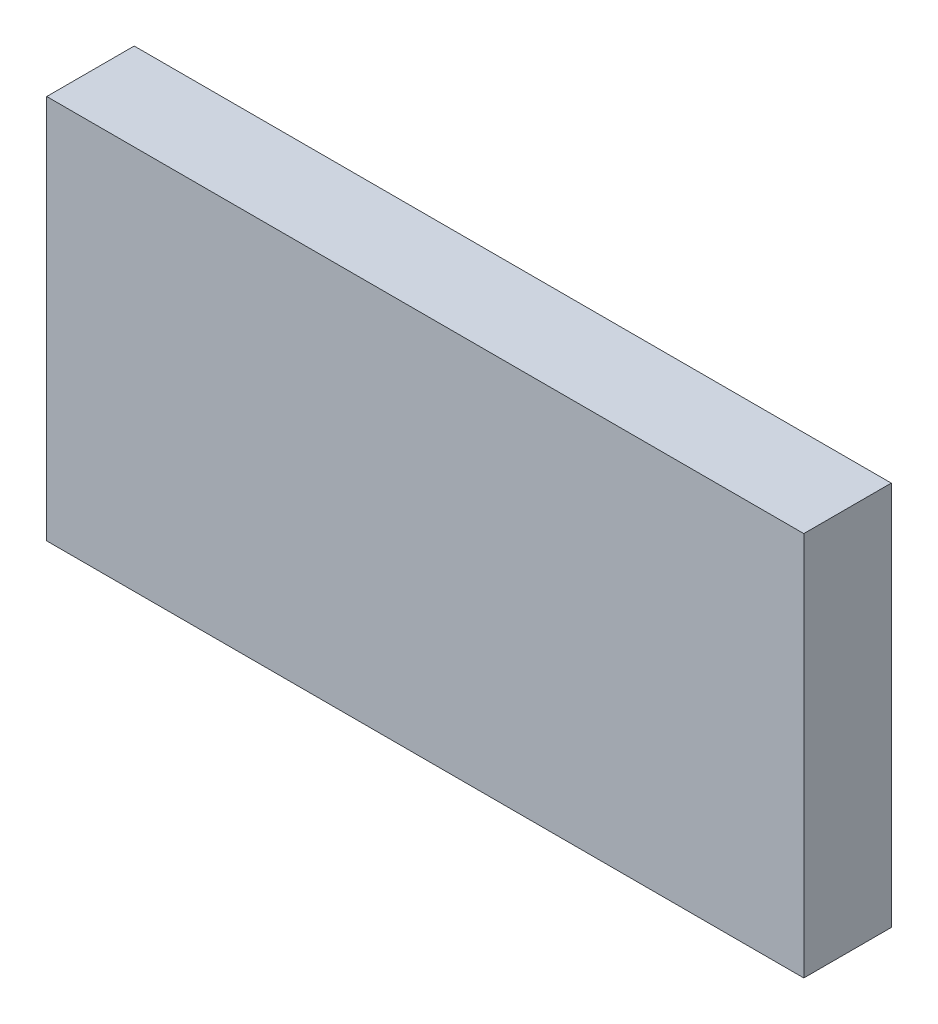
ISO-10303-21;
HEADER;
FILE_DESCRIPTION(('STEP AP214'),'2;1');
FILE_NAME('part.step','',(''),(''),'','','');
FILE_SCHEMA(('AUTOMOTIVE_DESIGN { 1 0 10303 214 1 1 1 1 }'));
ENDSEC;
DATA;
#1=APPLICATION_CONTEXT('core data for automotive mechanical design processes');
#2=APPLICATION_PROTOCOL_DEFINITION('international standard','automotive_design',2000,#1);
#3=PRODUCT_CONTEXT('',#1,'mechanical');
#4=PRODUCT('Part','Part','',(#3));
#5=PRODUCT_RELATED_PRODUCT_CATEGORY('part','',(#4));
#6=PRODUCT_DEFINITION_FORMATION('','',#4);
#7=PRODUCT_DEFINITION_CONTEXT('part definition',#1,'design');
#8=PRODUCT_DEFINITION('design','',#6,#7);
#9=PRODUCT_DEFINITION_SHAPE('','',#8);
#10=(LENGTH_UNIT() NAMED_UNIT(*) SI_UNIT(.MILLI.,.METRE.));
#11=(NAMED_UNIT(*) PLANE_ANGLE_UNIT() SI_UNIT($,.RADIAN.));
#12=(NAMED_UNIT(*) SI_UNIT($,.STERADIAN.) SOLID_ANGLE_UNIT());
#13=UNCERTAINTY_MEASURE_WITH_UNIT(LENGTH_MEASURE(1.E-05),#10,'distance_accuracy_value','');
#14=(GEOMETRIC_REPRESENTATION_CONTEXT(3) GLOBAL_UNCERTAINTY_ASSIGNED_CONTEXT((#13)) GLOBAL_UNIT_ASSIGNED_CONTEXT((#10,
#11,#12)) REPRESENTATION_CONTEXT('',''));
#15=CARTESIAN_POINT('',(0.,0.,0.));
#16=DIRECTION('',(0.,0.,1.));
#17=DIRECTION('',(1.,0.,0.));
#18=AXIS2_PLACEMENT_3D('',#15,#16,#17);
#19=CARTESIAN_POINT('',(-1.445,1.78,0.));
#20=DIRECTION('',(1.,0.,0.));
#21=DIRECTION('',(0.,0.,1.));
#22=AXIS2_PLACEMENT_3D('',#19,#20,#21);
#23=PLANE('',#22);
#24=DIRECTION('',(0.,1.,0.));
#25=VECTOR('',#24,1.);
#26=CARTESIAN_POINT('',(-1.445,1.78,0.1));
#27=LINE('',#26,#25);
#28=CARTESIAN_POINT('',(-1.445,1.78,0.1));
#29=VERTEX_POINT('',#28);
#30=CARTESIAN_POINT('',(-1.445,2.22,0.1));
#31=VERTEX_POINT('',#30);
#32=EDGE_CURVE('E11',#29,#31,#27,.T.);
#33=ORIENTED_EDGE('',*,*,#32,.T.);
#34=DIRECTION('',(0.,0.,1.));
#35=VECTOR('',#34,1.);
#36=CARTESIAN_POINT('',(-1.445,2.22,0.));
#37=LINE('',#36,#35);
#38=CARTESIAN_POINT('',(-1.445,2.22,0.));
#39=VERTEX_POINT('',#38);
#40=EDGE_CURVE('E24',#39,#31,#37,.T.);
#41=ORIENTED_EDGE('',*,*,#40,.F.);
#42=DIRECTION('',(0.,1.,0.));
#43=VECTOR('',#42,1.);
#44=CARTESIAN_POINT('',(-1.445,1.78,0.));
#45=LINE('',#44,#43);
#46=CARTESIAN_POINT('',(-1.445,1.78,0.));
#47=VERTEX_POINT('',#46);
#48=EDGE_CURVE('E86',#47,#39,#45,.T.);
#49=ORIENTED_EDGE('',*,*,#48,.F.);
#50=DIRECTION('',(0.,0.,1.));
#51=VECTOR('',#50,1.);
#52=CARTESIAN_POINT('',(-1.445,1.78,0.));
#53=LINE('',#52,#51);
#54=EDGE_CURVE('E36',#47,#29,#53,.T.);
#55=ORIENTED_EDGE('',*,*,#54,.T.);
#56=EDGE_LOOP('',(#33,#41,#49,#55));
#57=FACE_BOUND('',#56,.T.);
#58=ADVANCED_FACE('F17',(#57),#23,.F.);
#59=CARTESIAN_POINT('',(-0.5795,1.78,0.));
#60=DIRECTION('',(1.,0.,0.));
#61=DIRECTION('',(0.,0.,1.));
#62=AXIS2_PLACEMENT_3D('',#59,#60,#61);
#63=PLANE('',#62);
#64=DIRECTION('',(0.,0.,1.));
#65=VECTOR('',#64,1.);
#66=CARTESIAN_POINT('',(-0.5795,1.78,0.));
#67=LINE('',#66,#65);
#68=CARTESIAN_POINT('',(-0.5795,1.78,0.));
#69=VERTEX_POINT('',#68);
#70=CARTESIAN_POINT('',(-0.5795,1.78,0.1));
#71=VERTEX_POINT('',#70);
#72=EDGE_CURVE('E83',#69,#71,#67,.T.);
#73=ORIENTED_EDGE('',*,*,#72,.F.);
#74=DIRECTION('',(0.,1.,0.));
#75=VECTOR('',#74,1.);
#76=CARTESIAN_POINT('',(-0.5795,1.78,0.));
#77=LINE('',#76,#75);
#78=CARTESIAN_POINT('',(-0.5795,2.22,0.));
#79=VERTEX_POINT('',#78);
#80=EDGE_CURVE('E63',#69,#79,#77,.T.);
#81=ORIENTED_EDGE('',*,*,#80,.T.);
#82=DIRECTION('',(0.,0.,1.));
#83=VECTOR('',#82,1.);
#84=CARTESIAN_POINT('',(-0.5795,2.22,0.));
#85=LINE('',#84,#83);
#86=CARTESIAN_POINT('',(-0.5795,2.22,0.1));
#87=VERTEX_POINT('',#86);
#88=EDGE_CURVE('E57',#79,#87,#85,.T.);
#89=ORIENTED_EDGE('',*,*,#88,.T.);
#90=DIRECTION('',(0.,1.,0.));
#91=VECTOR('',#90,1.);
#92=CARTESIAN_POINT('',(-0.5795,1.78,0.1));
#93=LINE('',#92,#91);
#94=EDGE_CURVE('E60',#71,#87,#93,.T.);
#95=ORIENTED_EDGE('',*,*,#94,.F.);
#96=EDGE_LOOP('',(#73,#81,#89,#95));
#97=FACE_BOUND('',#96,.T.);
#98=ADVANCED_FACE('F59',(#97),#63,.T.);
#99=CARTESIAN_POINT('',(-1.445,1.78,0.));
#100=DIRECTION('',(0.,1.,0.));
#101=DIRECTION('',(0.,0.,1.));
#102=AXIS2_PLACEMENT_3D('',#99,#100,#101);
#103=PLANE('',#102);
#104=ORIENTED_EDGE('',*,*,#72,.T.);
#105=DIRECTION('',(1.,0.,0.));
#106=VECTOR('',#105,1.);
#107=CARTESIAN_POINT('',(-1.445,1.78,0.1));
#108=LINE('',#107,#106);
#109=EDGE_CURVE('E71',#29,#71,#108,.T.);
#110=ORIENTED_EDGE('',*,*,#109,.F.);
#111=ORIENTED_EDGE('',*,*,#54,.F.);
#112=DIRECTION('',(1.,0.,0.));
#113=VECTOR('',#112,1.);
#114=CARTESIAN_POINT('',(-1.445,1.78,0.));
#115=LINE('',#114,#113);
#116=EDGE_CURVE('E76',#47,#69,#115,.T.);
#117=ORIENTED_EDGE('',*,*,#116,.T.);
#118=EDGE_LOOP('',(#104,#110,#111,#117));
#119=FACE_BOUND('',#118,.T.);
#120=ADVANCED_FACE('F91',(#119),#103,.F.);
#121=CARTESIAN_POINT('',(-1.445,2.22,0.));
#122=DIRECTION('',(0.,1.,0.));
#123=DIRECTION('',(0.,0.,1.));
#124=AXIS2_PLACEMENT_3D('',#121,#122,#123);
#125=PLANE('',#124);
#126=DIRECTION('',(1.,0.,0.));
#127=VECTOR('',#126,1.);
#128=CARTESIAN_POINT('',(-1.445,2.22,0.));
#129=LINE('',#128,#127);
#130=EDGE_CURVE('E74',#39,#79,#129,.T.);
#131=ORIENTED_EDGE('',*,*,#130,.F.);
#132=ORIENTED_EDGE('',*,*,#40,.T.);
#133=DIRECTION('',(1.,0.,0.));
#134=VECTOR('',#133,1.);
#135=CARTESIAN_POINT('',(-1.445,2.22,0.1));
#136=LINE('',#135,#134);
#137=EDGE_CURVE('E69',#31,#87,#136,.T.);
#138=ORIENTED_EDGE('',*,*,#137,.T.);
#139=ORIENTED_EDGE('',*,*,#88,.F.);
#140=EDGE_LOOP('',(#131,#132,#138,#139));
#141=FACE_BOUND('',#140,.T.);
#142=ADVANCED_FACE('F73',(#141),#125,.T.);
#143=CARTESIAN_POINT('',(-1.445,1.78,0.));
#144=DIRECTION('',(0.,0.,1.));
#145=DIRECTION('',(1.,0.,0.));
#146=AXIS2_PLACEMENT_3D('',#143,#144,#145);
#147=PLANE('',#146);
#148=ORIENTED_EDGE('',*,*,#130,.T.);
#149=ORIENTED_EDGE('',*,*,#80,.F.);
#150=ORIENTED_EDGE('',*,*,#116,.F.);
#151=ORIENTED_EDGE('',*,*,#48,.T.);
#152=EDGE_LOOP('',(#148,#149,#150,#151));
#153=FACE_BOUND('',#152,.T.);
#154=ADVANCED_FACE('F89',(#153),#147,.F.);
#155=CARTESIAN_POINT('',(-1.445,1.78,0.1));
#156=DIRECTION('',(0.,0.,1.));
#157=DIRECTION('',(1.,0.,0.));
#158=AXIS2_PLACEMENT_3D('',#155,#156,#157);
#159=PLANE('',#158);
#160=ORIENTED_EDGE('',*,*,#32,.F.);
#161=ORIENTED_EDGE('',*,*,#109,.T.);
#162=ORIENTED_EDGE('',*,*,#94,.T.);
#163=ORIENTED_EDGE('',*,*,#137,.F.);
#164=EDGE_LOOP('',(#160,#161,#162,#163));
#165=FACE_BOUND('',#164,.T.);
#166=ADVANCED_FACE('F68',(#165),#159,.T.);
#167=CLOSED_SHELL('',(#58,#98,#120,#142,#154,#166));
#168=MANIFOLD_SOLID_BREP('B1',#167);
#169=ADVANCED_BREP_SHAPE_REPRESENTATION('',(#18,#168),#14);
#170=SHAPE_DEFINITION_REPRESENTATION(#9,#169);
ENDSEC;
END-ISO-10303-21;
